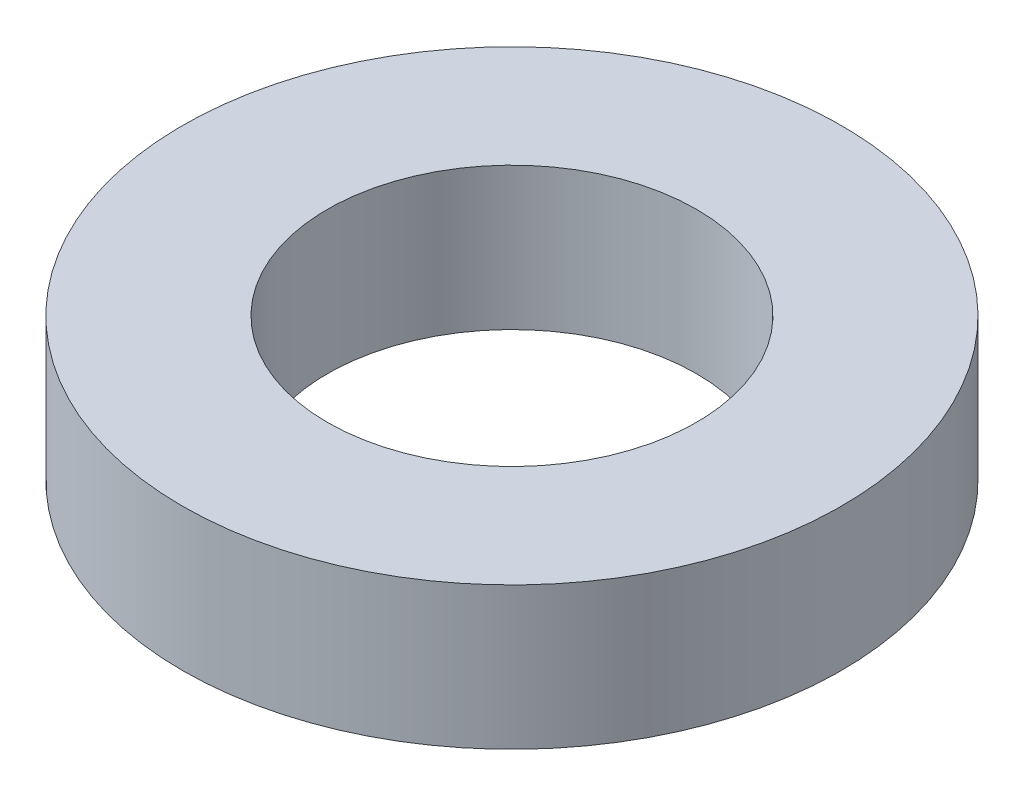
ISO-10303-21;
HEADER;
FILE_DESCRIPTION(('STEP AP214'),'2;1');
FILE_NAME('part.step','',(''),(''),'','','');
FILE_SCHEMA(('AUTOMOTIVE_DESIGN { 1 0 10303 214 1 1 1 1 }'));
ENDSEC;
DATA;
#1=APPLICATION_CONTEXT('core data for automotive mechanical design processes');
#2=APPLICATION_PROTOCOL_DEFINITION('international standard','automotive_design',2000,#1);
#3=PRODUCT_CONTEXT('',#1,'mechanical');
#4=PRODUCT('Part','Part','',(#3));
#5=PRODUCT_RELATED_PRODUCT_CATEGORY('part','',(#4));
#6=PRODUCT_DEFINITION_FORMATION('','',#4);
#7=PRODUCT_DEFINITION_CONTEXT('part definition',#1,'design');
#8=PRODUCT_DEFINITION('design','',#6,#7);
#9=PRODUCT_DEFINITION_SHAPE('','',#8);
#10=(LENGTH_UNIT() NAMED_UNIT(*) SI_UNIT(.MILLI.,.METRE.));
#11=(NAMED_UNIT(*) PLANE_ANGLE_UNIT() SI_UNIT($,.RADIAN.));
#12=(NAMED_UNIT(*) SI_UNIT($,.STERADIAN.) SOLID_ANGLE_UNIT());
#13=UNCERTAINTY_MEASURE_WITH_UNIT(LENGTH_MEASURE(1.E-05),#10,'distance_accuracy_value','');
#14=(GEOMETRIC_REPRESENTATION_CONTEXT(3) GLOBAL_UNCERTAINTY_ASSIGNED_CONTEXT((#13)) GLOBAL_UNIT_ASSIGNED_CONTEXT((#10,
#11,#12)) REPRESENTATION_CONTEXT('',''));
#15=CARTESIAN_POINT('',(0.,0.,0.));
#16=DIRECTION('',(0.,0.,1.));
#17=DIRECTION('',(1.,0.,0.));
#18=AXIS2_PLACEMENT_3D('',#15,#16,#17);
#19=CARTESIAN_POINT('',(0.,27.,0.));
#20=DIRECTION('',(0.,-1.,0.));
#21=DIRECTION('',(0.,0.,-1.));
#22=AXIS2_PLACEMENT_3D('',#19,#20,#21);
#23=CYLINDRICAL_SURFACE('',#22,62.5);
#24=CARTESIAN_POINT('',(0.,27.,0.));
#25=DIRECTION('',(0.,1.,0.));
#26=DIRECTION('',(0.,0.,1.));
#27=AXIS2_PLACEMENT_3D('',#24,#25,#26);
#28=CIRCLE('',#27,62.5);
#29=CARTESIAN_POINT('',(0.,27.,62.5));
#30=VERTEX_POINT('',#29);
#31=EDGE_CURVE('E10',#30,#30,#28,.T.);
#32=ORIENTED_EDGE('',*,*,#31,.F.);
#33=EDGE_LOOP('',(#32));
#34=FACE_BOUND('',#33,.T.);
#35=CARTESIAN_POINT('',(0.,0.,0.));
#36=DIRECTION('',(0.,1.,0.));
#37=DIRECTION('',(0.,0.,1.));
#38=AXIS2_PLACEMENT_3D('',#35,#36,#37);
#39=CIRCLE('',#38,62.5);
#40=CARTESIAN_POINT('',(0.,0.,62.5));
#41=VERTEX_POINT('',#40);
#42=EDGE_CURVE('E37',#41,#41,#39,.T.);
#43=ORIENTED_EDGE('',*,*,#42,.T.);
#44=EDGE_LOOP('',(#43));
#45=FACE_BOUND('',#44,.T.);
#46=ADVANCED_FACE('F40',(#34,#45),#23,.T.);
#47=CARTESIAN_POINT('',(0.,27.,0.));
#48=DIRECTION('',(0.,1.,0.));
#49=DIRECTION('',(0.,0.,1.));
#50=AXIS2_PLACEMENT_3D('',#47,#48,#49);
#51=PLANE('',#50);
#52=CARTESIAN_POINT('',(0.,27.,0.));
#53=DIRECTION('',(0.,1.,0.));
#54=DIRECTION('',(0.,0.,1.));
#55=AXIS2_PLACEMENT_3D('',#52,#53,#54);
#56=CIRCLE('',#55,35.);
#57=CARTESIAN_POINT('',(0.,27.,35.));
#58=VERTEX_POINT('',#57);
#59=EDGE_CURVE('E50',#58,#58,#56,.T.);
#60=ORIENTED_EDGE('',*,*,#59,.F.);
#61=EDGE_LOOP('',(#60));
#62=FACE_BOUND('',#61,.T.);
#63=ORIENTED_EDGE('',*,*,#31,.T.);
#64=EDGE_LOOP('',(#63));
#65=FACE_BOUND('',#64,.T.);
#66=ADVANCED_FACE('F59',(#62,#65),#51,.T.);
#67=CARTESIAN_POINT('',(0.,0.,0.));
#68=DIRECTION('',(0.,1.,0.));
#69=DIRECTION('',(0.,0.,1.));
#70=AXIS2_PLACEMENT_3D('',#67,#68,#69);
#71=PLANE('',#70);
#72=CARTESIAN_POINT('',(0.,0.,0.));
#73=DIRECTION('',(0.,1.,0.));
#74=DIRECTION('',(0.,0.,1.));
#75=AXIS2_PLACEMENT_3D('',#72,#73,#74);
#76=CIRCLE('',#75,35.);
#77=CARTESIAN_POINT('',(0.,0.,35.));
#78=VERTEX_POINT('',#77);
#79=EDGE_CURVE('E47',#78,#78,#76,.T.);
#80=ORIENTED_EDGE('',*,*,#79,.T.);
#81=EDGE_LOOP('',(#80));
#82=FACE_BOUND('',#81,.T.);
#83=ORIENTED_EDGE('',*,*,#42,.F.);
#84=EDGE_LOOP('',(#83));
#85=FACE_BOUND('',#84,.T.);
#86=ADVANCED_FACE('F58',(#82,#85),#71,.F.);
#87=CARTESIAN_POINT('',(0.,27.,0.));
#88=DIRECTION('',(0.,-1.,0.));
#89=DIRECTION('',(0.,0.,-1.));
#90=AXIS2_PLACEMENT_3D('',#87,#88,#89);
#91=CYLINDRICAL_SURFACE('',#90,35.);
#92=ORIENTED_EDGE('',*,*,#59,.T.);
#93=EDGE_LOOP('',(#92));
#94=FACE_BOUND('',#93,.T.);
#95=ORIENTED_EDGE('',*,*,#79,.F.);
#96=EDGE_LOOP('',(#95));
#97=FACE_BOUND('',#96,.T.);
#98=ADVANCED_FACE('F54',(#94,#97),#91,.F.);
#99=CLOSED_SHELL('',(#46,#66,#86,#98));
#100=MANIFOLD_SOLID_BREP('B2',#99);
#101=ADVANCED_BREP_SHAPE_REPRESENTATION('',(#18,#100),#14);
#102=SHAPE_DEFINITION_REPRESENTATION(#9,#101);
ENDSEC;
END-ISO-10303-21;
